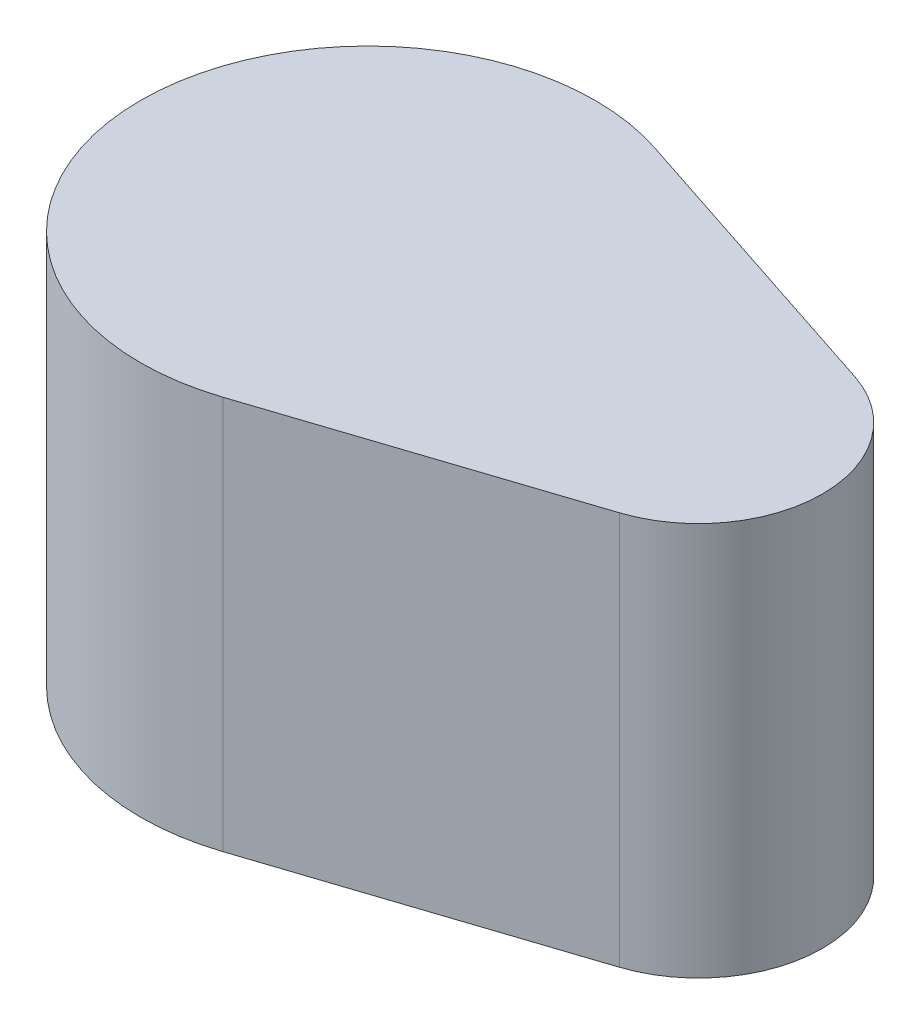
ISO-10303-21;
HEADER;
FILE_DESCRIPTION(('STEP AP214'),'2;1');
FILE_NAME('part.step','',(''),(''),'','','');
FILE_SCHEMA(('AUTOMOTIVE_DESIGN { 1 0 10303 214 1 1 1 1 }'));
ENDSEC;
DATA;
#1=APPLICATION_CONTEXT('core data for automotive mechanical design processes');
#2=APPLICATION_PROTOCOL_DEFINITION('international standard','automotive_design',2000,#1);
#3=PRODUCT_CONTEXT('',#1,'mechanical');
#4=PRODUCT('Part','Part','',(#3));
#5=PRODUCT_RELATED_PRODUCT_CATEGORY('part','',(#4));
#6=PRODUCT_DEFINITION_FORMATION('','',#4);
#7=PRODUCT_DEFINITION_CONTEXT('part definition',#1,'design');
#8=PRODUCT_DEFINITION('design','',#6,#7);
#9=PRODUCT_DEFINITION_SHAPE('','',#8);
#10=(LENGTH_UNIT() NAMED_UNIT(*) SI_UNIT(.MILLI.,.METRE.));
#11=(NAMED_UNIT(*) PLANE_ANGLE_UNIT() SI_UNIT($,.RADIAN.));
#12=(NAMED_UNIT(*) SI_UNIT($,.STERADIAN.) SOLID_ANGLE_UNIT());
#13=UNCERTAINTY_MEASURE_WITH_UNIT(LENGTH_MEASURE(1.E-05),#10,'distance_accuracy_value','');
#14=(GEOMETRIC_REPRESENTATION_CONTEXT(3) GLOBAL_UNCERTAINTY_ASSIGNED_CONTEXT((#13)) GLOBAL_UNIT_ASSIGNED_CONTEXT((#10,
#11,#12)) REPRESENTATION_CONTEXT('',''));
#15=CARTESIAN_POINT('',(0.,0.,0.));
#16=DIRECTION('',(0.,0.,1.));
#17=DIRECTION('',(1.,0.,0.));
#18=AXIS2_PLACEMENT_3D('',#15,#16,#17);
#19=CARTESIAN_POINT('',(0.,9.525,0.));
#20=DIRECTION('',(0.,-1.,0.));
#21=DIRECTION('',(0.,0.,-1.));
#22=AXIS2_PLACEMENT_3D('',#19,#20,#21);
#23=CYLINDRICAL_SURFACE('',#22,5.500000049);
#24=CARTESIAN_POINT('',(0.,0.,0.));
#25=DIRECTION('',(0.,1.,0.));
#26=DIRECTION('',(0.,0.,1.));
#27=AXIS2_PLACEMENT_3D('',#24,#25,#26);
#28=CIRCLE('',#27,5.500000049);
#29=CARTESIAN_POINT('',(1.71875005952734,0.,-5.22454770979027));
#30=VERTEX_POINT('',#29);
#31=CARTESIAN_POINT('',(1.71875005952734,0.,5.22454770979027));
#32=VERTEX_POINT('',#31);
#33=EDGE_CURVE('E100',#30,#32,#28,.T.);
#34=ORIENTED_EDGE('',*,*,#33,.T.);
#35=DIRECTION('',(0.,-1.,0.));
#36=VECTOR('',#35,1.);
#37=CARTESIAN_POINT('',(1.71875005952734,9.525,5.22454770979027));
#38=LINE('',#37,#36);
#39=CARTESIAN_POINT('',(1.71875005952734,9.525,5.22454770979027));
#40=VERTEX_POINT('',#39);
#41=EDGE_CURVE('E11',#40,#32,#38,.T.);
#42=ORIENTED_EDGE('',*,*,#41,.F.);
#43=CARTESIAN_POINT('',(0.,9.525,0.));
#44=DIRECTION('',(0.,1.,0.));
#45=DIRECTION('',(0.,0.,1.));
#46=AXIS2_PLACEMENT_3D('',#43,#44,#45);
#47=CIRCLE('',#46,5.500000049);
#48=CARTESIAN_POINT('',(1.71875005952734,9.525,-5.22454770979027));
#49=VERTEX_POINT('',#48);
#50=EDGE_CURVE('E88',#49,#40,#47,.T.);
#51=ORIENTED_EDGE('',*,*,#50,.F.);
#52=DIRECTION('',(0.,-1.,0.));
#53=VECTOR('',#52,1.);
#54=CARTESIAN_POINT('',(1.71875005952734,9.525,-5.22454770979027));
#55=LINE('',#54,#53);
#56=EDGE_CURVE('E96',#49,#30,#55,.T.);
#57=ORIENTED_EDGE('',*,*,#56,.T.);
#58=EDGE_LOOP('',(#34,#42,#51,#57));
#59=FACE_BOUND('',#58,.T.);
#60=ADVANCED_FACE('F37',(#59),#23,.T.);
#61=CARTESIAN_POINT('',(1.71875005952734,9.525,5.22454770979027));
#62=DIRECTION('',(-0.312500008039063,0.,-0.949917756953509));
#63=DIRECTION('',(-0.949917756953509,0.,0.312500008039062));
#64=AXIS2_PLACEMENT_3D('',#61,#62,#63);
#65=PLANE('',#64);
#66=DIRECTION('',(0.949917756953509,0.,-0.312500008039062));
#67=VECTOR('',#66,1.);
#68=CARTESIAN_POINT('',(1.71875005952734,0.,5.22454770979027));
#69=LINE('',#68,#67);
#70=CARTESIAN_POINT('',(8.93749997511719,0.,2.84975327086053));
#71=VERTEX_POINT('',#70);
#72=EDGE_CURVE('E92',#32,#71,#69,.T.);
#73=ORIENTED_EDGE('',*,*,#72,.T.);
#74=DIRECTION('',(0.,-1.,0.));
#75=VECTOR('',#74,1.);
#76=CARTESIAN_POINT('',(8.93749997511719,9.525,2.84975327086053));
#77=LINE('',#76,#75);
#78=CARTESIAN_POINT('',(8.93749997511719,9.525,2.84975327086053));
#79=VERTEX_POINT('',#78);
#80=EDGE_CURVE('E45',#79,#71,#77,.T.);
#81=ORIENTED_EDGE('',*,*,#80,.F.);
#82=DIRECTION('',(0.949917756953509,0.,-0.312500008039062));
#83=VECTOR('',#82,1.);
#84=CARTESIAN_POINT('',(1.71875005952734,9.525,5.22454770979027));
#85=LINE('',#84,#83);
#86=EDGE_CURVE('E83',#40,#79,#85,.T.);
#87=ORIENTED_EDGE('',*,*,#86,.F.);
#88=ORIENTED_EDGE('',*,*,#41,.T.);
#89=EDGE_LOOP('',(#73,#81,#87,#88));
#90=FACE_BOUND('',#89,.T.);
#91=ADVANCED_FACE('F91',(#90),#65,.F.);
#92=CARTESIAN_POINT('',(7.999999951,9.525,0.));
#93=DIRECTION('',(0.,-1.,0.));
#94=DIRECTION('',(0.,0.,-1.));
#95=AXIS2_PLACEMENT_3D('',#92,#93,#94);
#96=CYLINDRICAL_SURFACE('',#95,3.);
#97=CARTESIAN_POINT('',(7.999999951,0.,0.));
#98=DIRECTION('',(0.,1.,0.));
#99=DIRECTION('',(0.,0.,1.));
#100=AXIS2_PLACEMENT_3D('',#97,#98,#99);
#101=CIRCLE('',#100,3.);
#102=CARTESIAN_POINT('',(8.93749997511719,0.,-2.84975327086053));
#103=VERTEX_POINT('',#102);
#104=EDGE_CURVE('E70',#71,#103,#101,.T.);
#105=ORIENTED_EDGE('',*,*,#104,.T.);
#106=DIRECTION('',(0.,-1.,0.));
#107=VECTOR('',#106,1.);
#108=CARTESIAN_POINT('',(8.93749997511719,9.525,-2.84975327086053));
#109=LINE('',#108,#107);
#110=CARTESIAN_POINT('',(8.93749997511719,9.525,-2.84975327086053));
#111=VERTEX_POINT('',#110);
#112=EDGE_CURVE('E93',#111,#103,#109,.T.);
#113=ORIENTED_EDGE('',*,*,#112,.F.);
#114=CARTESIAN_POINT('',(7.999999951,9.525,0.));
#115=DIRECTION('',(0.,1.,0.));
#116=DIRECTION('',(0.,0.,1.));
#117=AXIS2_PLACEMENT_3D('',#114,#115,#116);
#118=CIRCLE('',#117,3.);
#119=EDGE_CURVE('E86',#79,#111,#118,.T.);
#120=ORIENTED_EDGE('',*,*,#119,.F.);
#121=ORIENTED_EDGE('',*,*,#80,.T.);
#122=EDGE_LOOP('',(#105,#113,#120,#121));
#123=FACE_BOUND('',#122,.T.);
#124=ADVANCED_FACE('F94',(#123),#96,.T.);
#125=CARTESIAN_POINT('',(1.71875005952734,9.525,-5.22454770979027));
#126=DIRECTION('',(-0.312500008039063,0.,0.949917756953509));
#127=DIRECTION('',(0.949917756953509,0.,0.312500008039063));
#128=AXIS2_PLACEMENT_3D('',#125,#126,#127);
#129=PLANE('',#128);
#130=DIRECTION('',(-0.949917756953509,0.,-0.312500008039063));
#131=VECTOR('',#130,1.);
#132=CARTESIAN_POINT('',(1.71875005952734,0.,-5.22454770979027));
#133=LINE('',#132,#131);
#134=EDGE_CURVE('E76',#103,#30,#133,.T.);
#135=ORIENTED_EDGE('',*,*,#134,.T.);
#136=ORIENTED_EDGE('',*,*,#56,.F.);
#137=DIRECTION('',(-0.949917756953509,0.,-0.312500008039063));
#138=VECTOR('',#137,1.);
#139=CARTESIAN_POINT('',(1.71875005952734,9.525,-5.22454770979027));
#140=LINE('',#139,#138);
#141=EDGE_CURVE('E53',#111,#49,#140,.T.);
#142=ORIENTED_EDGE('',*,*,#141,.F.);
#143=ORIENTED_EDGE('',*,*,#112,.T.);
#144=EDGE_LOOP('',(#135,#136,#142,#143));
#145=FACE_BOUND('',#144,.T.);
#146=ADVANCED_FACE('F107',(#145),#129,.F.);
#147=CARTESIAN_POINT('',(0.,9.525,0.));
#148=DIRECTION('',(0.,1.,0.));
#149=DIRECTION('',(0.,0.,1.));
#150=AXIS2_PLACEMENT_3D('',#147,#148,#149);
#151=PLANE('',#150);
#152=ORIENTED_EDGE('',*,*,#50,.T.);
#153=ORIENTED_EDGE('',*,*,#86,.T.);
#154=ORIENTED_EDGE('',*,*,#119,.T.);
#155=ORIENTED_EDGE('',*,*,#141,.T.);
#156=EDGE_LOOP('',(#152,#153,#154,#155));
#157=FACE_BOUND('',#156,.T.);
#158=ADVANCED_FACE('F84',(#157),#151,.T.);
#159=CARTESIAN_POINT('',(0.,0.,0.));
#160=DIRECTION('',(0.,1.,0.));
#161=DIRECTION('',(0.,0.,1.));
#162=AXIS2_PLACEMENT_3D('',#159,#160,#161);
#163=PLANE('',#162);
#164=ORIENTED_EDGE('',*,*,#33,.F.);
#165=ORIENTED_EDGE('',*,*,#134,.F.);
#166=ORIENTED_EDGE('',*,*,#104,.F.);
#167=ORIENTED_EDGE('',*,*,#72,.F.);
#168=EDGE_LOOP('',(#164,#165,#166,#167));
#169=FACE_BOUND('',#168,.T.);
#170=ADVANCED_FACE('F110',(#169),#163,.F.);
#171=CLOSED_SHELL('',(#60,#91,#124,#146,#158,#170));
#172=MANIFOLD_SOLID_BREP('B2',#171);
#173=ADVANCED_BREP_SHAPE_REPRESENTATION('',(#18,#172),#14);
#174=SHAPE_DEFINITION_REPRESENTATION(#9,#173);
ENDSEC;
END-ISO-10303-21;
